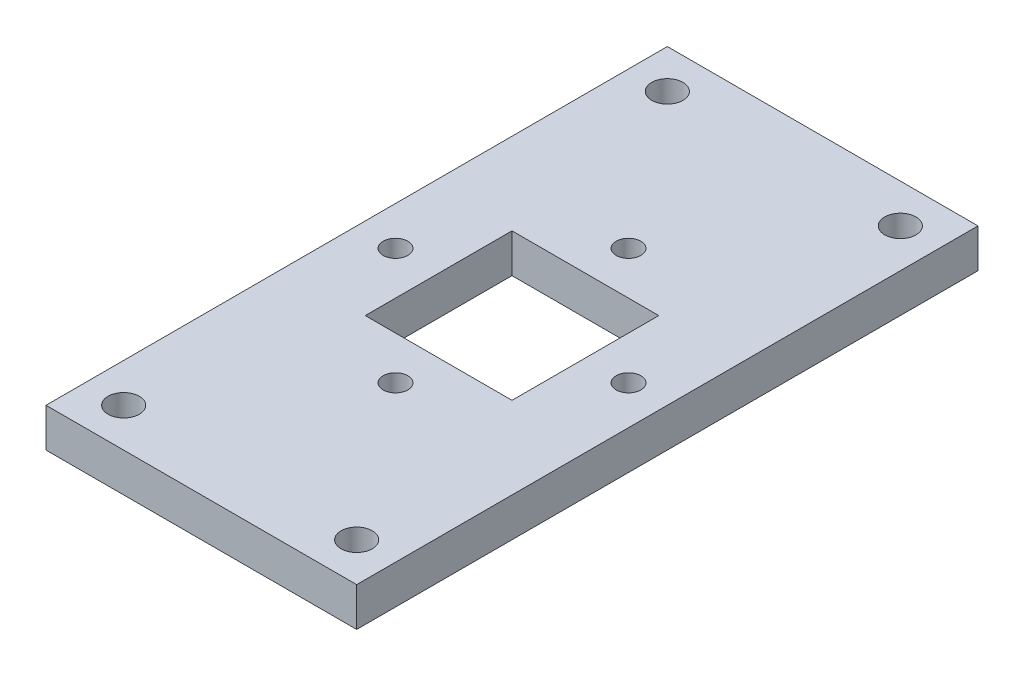
ISO-10303-21;
HEADER;
FILE_DESCRIPTION(('STEP AP214'),'2;1');
FILE_NAME('part.step','',(''),(''),'','','');
FILE_SCHEMA(('AUTOMOTIVE_DESIGN { 1 0 10303 214 1 1 1 1 }'));
ENDSEC;
DATA;
#1=APPLICATION_CONTEXT('core data for automotive mechanical design processes');
#2=APPLICATION_PROTOCOL_DEFINITION('international standard','automotive_design',2000,#1);
#3=PRODUCT_CONTEXT('',#1,'mechanical');
#4=PRODUCT('Part','Part','',(#3));
#5=PRODUCT_RELATED_PRODUCT_CATEGORY('part','',(#4));
#6=PRODUCT_DEFINITION_FORMATION('','',#4);
#7=PRODUCT_DEFINITION_CONTEXT('part definition',#1,'design');
#8=PRODUCT_DEFINITION('design','',#6,#7);
#9=PRODUCT_DEFINITION_SHAPE('','',#8);
#10=(LENGTH_UNIT() NAMED_UNIT(*) SI_UNIT(.MILLI.,.METRE.));
#11=(NAMED_UNIT(*) PLANE_ANGLE_UNIT() SI_UNIT($,.RADIAN.));
#12=(NAMED_UNIT(*) SI_UNIT($,.STERADIAN.) SOLID_ANGLE_UNIT());
#13=UNCERTAINTY_MEASURE_WITH_UNIT(LENGTH_MEASURE(1.E-05),#10,'distance_accuracy_value','');
#14=(GEOMETRIC_REPRESENTATION_CONTEXT(3) GLOBAL_UNCERTAINTY_ASSIGNED_CONTEXT((#13)) GLOBAL_UNIT_ASSIGNED_CONTEXT((#10,
#11,#12)) REPRESENTATION_CONTEXT('',''));
#15=CARTESIAN_POINT('',(0.,0.,0.));
#16=DIRECTION('',(0.,0.,1.));
#17=DIRECTION('',(1.,0.,0.));
#18=AXIS2_PLACEMENT_3D('',#15,#16,#17);
#19=CARTESIAN_POINT('',(-43.46194,12.7,-50.8));
#20=DIRECTION('',(1.,0.,0.));
#21=DIRECTION('',(0.,0.,-1.));
#22=AXIS2_PLACEMENT_3D('',#19,#20,#21);
#23=PLANE('',#22);
#24=DIRECTION('',(0.,0.,-1.));
#25=VECTOR('',#24,1.);
#26=CARTESIAN_POINT('',(-43.46194,19.05,-50.8));
#27=LINE('',#26,#25);
#28=CARTESIAN_POINT('',(-43.46194,19.05,50.8));
#29=VERTEX_POINT('',#28);
#30=CARTESIAN_POINT('',(-43.46194,19.05,-50.8));
#31=VERTEX_POINT('',#30);
#32=EDGE_CURVE('E121',#29,#31,#27,.T.);
#33=ORIENTED_EDGE('',*,*,#32,.F.);
#34=DIRECTION('',(0.,1.,0.));
#35=VECTOR('',#34,1.);
#36=CARTESIAN_POINT('',(-43.46194,12.7,50.8));
#37=LINE('',#36,#35);
#38=CARTESIAN_POINT('',(-43.46194,12.7,50.8));
#39=VERTEX_POINT('',#38);
#40=EDGE_CURVE('E11',#39,#29,#37,.T.);
#41=ORIENTED_EDGE('',*,*,#40,.F.);
#42=DIRECTION('',(0.,0.,-1.));
#43=VECTOR('',#42,1.);
#44=CARTESIAN_POINT('',(-43.46194,12.7,-50.8));
#45=LINE('',#44,#43);
#46=CARTESIAN_POINT('',(-43.46194,12.7,-50.8));
#47=VERTEX_POINT('',#46);
#48=EDGE_CURVE('E153',#39,#47,#45,.T.);
#49=ORIENTED_EDGE('',*,*,#48,.T.);
#50=DIRECTION('',(0.,1.,0.));
#51=VECTOR('',#50,1.);
#52=CARTESIAN_POINT('',(-43.46194,12.7,-50.8));
#53=LINE('',#52,#51);
#54=EDGE_CURVE('E42',#47,#31,#53,.T.);
#55=ORIENTED_EDGE('',*,*,#54,.T.);
#56=EDGE_LOOP('',(#33,#41,#49,#55));
#57=FACE_BOUND('',#56,.T.);
#58=ADVANCED_FACE('F39',(#57),#23,.T.);
#59=CARTESIAN_POINT('',(-94.26194,12.7,50.8));
#60=DIRECTION('',(0.,0.,1.));
#61=DIRECTION('',(1.,0.,0.));
#62=AXIS2_PLACEMENT_3D('',#59,#60,#61);
#63=PLANE('',#62);
#64=DIRECTION('',(1.,0.,0.));
#65=VECTOR('',#64,1.);
#66=CARTESIAN_POINT('',(-94.26194,19.05,50.8));
#67=LINE('',#66,#65);
#68=CARTESIAN_POINT('',(-94.26194,19.05,50.8));
#69=VERTEX_POINT('',#68);
#70=EDGE_CURVE('E158',#69,#29,#67,.T.);
#71=ORIENTED_EDGE('',*,*,#70,.F.);
#72=DIRECTION('',(0.,1.,0.));
#73=VECTOR('',#72,1.);
#74=CARTESIAN_POINT('',(-94.26194,12.7,50.8));
#75=LINE('',#74,#73);
#76=CARTESIAN_POINT('',(-94.26194,12.7,50.8));
#77=VERTEX_POINT('',#76);
#78=EDGE_CURVE('E48',#77,#69,#75,.T.);
#79=ORIENTED_EDGE('',*,*,#78,.F.);
#80=DIRECTION('',(1.,0.,0.));
#81=VECTOR('',#80,1.);
#82=CARTESIAN_POINT('',(-94.26194,12.7,50.8));
#83=LINE('',#82,#81);
#84=EDGE_CURVE('E166',#77,#39,#83,.T.);
#85=ORIENTED_EDGE('',*,*,#84,.T.);
#86=ORIENTED_EDGE('',*,*,#40,.T.);
#87=EDGE_LOOP('',(#71,#79,#85,#86));
#88=FACE_BOUND('',#87,.T.);
#89=ADVANCED_FACE('F200',(#88),#63,.T.);
#90=CARTESIAN_POINT('',(-94.26194,12.7,-50.8));
#91=DIRECTION('',(-1.,0.,0.));
#92=DIRECTION('',(0.,0.,1.));
#93=AXIS2_PLACEMENT_3D('',#90,#91,#92);
#94=PLANE('',#93);
#95=DIRECTION('',(0.,0.,1.));
#96=VECTOR('',#95,1.);
#97=CARTESIAN_POINT('',(-94.26194,19.05,-50.8));
#98=LINE('',#97,#96);
#99=CARTESIAN_POINT('',(-94.26194,19.05,-50.8));
#100=VERTEX_POINT('',#99);
#101=EDGE_CURVE('E177',#100,#69,#98,.T.);
#102=ORIENTED_EDGE('',*,*,#101,.F.);
#103=DIRECTION('',(0.,1.,0.));
#104=VECTOR('',#103,1.);
#105=CARTESIAN_POINT('',(-94.26194,12.7,-50.8));
#106=LINE('',#105,#104);
#107=CARTESIAN_POINT('',(-94.26194,12.7,-50.8));
#108=VERTEX_POINT('',#107);
#109=EDGE_CURVE('E185',#108,#100,#106,.T.);
#110=ORIENTED_EDGE('',*,*,#109,.F.);
#111=DIRECTION('',(0.,0.,1.));
#112=VECTOR('',#111,1.);
#113=CARTESIAN_POINT('',(-94.26194,12.7,-50.8));
#114=LINE('',#113,#112);
#115=EDGE_CURVE('E162',#108,#77,#114,.T.);
#116=ORIENTED_EDGE('',*,*,#115,.T.);
#117=ORIENTED_EDGE('',*,*,#78,.T.);
#118=EDGE_LOOP('',(#102,#110,#116,#117));
#119=FACE_BOUND('',#118,.T.);
#120=ADVANCED_FACE('F204',(#119),#94,.T.);
#121=CARTESIAN_POINT('',(-94.26194,12.7,-50.8));
#122=DIRECTION('',(0.,0.,-1.));
#123=DIRECTION('',(-1.,0.,0.));
#124=AXIS2_PLACEMENT_3D('',#121,#122,#123);
#125=PLANE('',#124);
#126=DIRECTION('',(-1.,0.,0.));
#127=VECTOR('',#126,1.);
#128=CARTESIAN_POINT('',(-94.26194,19.05,-50.8));
#129=LINE('',#128,#127);
#130=EDGE_CURVE('E173',#31,#100,#129,.T.);
#131=ORIENTED_EDGE('',*,*,#130,.F.);
#132=ORIENTED_EDGE('',*,*,#54,.F.);
#133=DIRECTION('',(-1.,0.,0.));
#134=VECTOR('',#133,1.);
#135=CARTESIAN_POINT('',(-94.26194,12.7,-50.8));
#136=LINE('',#135,#134);
#137=EDGE_CURVE('E157',#47,#108,#136,.T.);
#138=ORIENTED_EDGE('',*,*,#137,.T.);
#139=ORIENTED_EDGE('',*,*,#109,.T.);
#140=EDGE_LOOP('',(#131,#132,#138,#139));
#141=FACE_BOUND('',#140,.T.);
#142=ADVANCED_FACE('F195',(#141),#125,.T.);
#143=CARTESIAN_POINT('',(0.,12.7,0.));
#144=DIRECTION('',(0.,1.,0.));
#145=DIRECTION('',(0.,0.,1.));
#146=AXIS2_PLACEMENT_3D('',#143,#144,#145);
#147=PLANE('',#146);
#148=CARTESIAN_POINT('',(-87.91194,12.7,0.));
#149=DIRECTION('',(0.,1.,0.));
#150=DIRECTION('',(0.,0.,1.));
#151=AXIS2_PLACEMENT_3D('',#148,#149,#150);
#152=CIRCLE('',#151,2.01930000000001);
#153=CARTESIAN_POINT('',(-87.91194,12.7,2.01930000000001));
#154=VERTEX_POINT('',#153);
#155=EDGE_CURVE('E373',#154,#154,#152,.F.);
#156=ORIENTED_EDGE('',*,*,#155,.F.);
#157=EDGE_LOOP('',(#156));
#158=FACE_BOUND('',#157,.T.);
#159=CARTESIAN_POINT('',(-49.81194,12.7,0.));
#160=DIRECTION('',(0.,1.,0.));
#161=DIRECTION('',(0.,0.,1.));
#162=AXIS2_PLACEMENT_3D('',#159,#160,#161);
#163=CIRCLE('',#162,2.0193);
#164=CARTESIAN_POINT('',(-49.81194,12.7,2.0193));
#165=VERTEX_POINT('',#164);
#166=EDGE_CURVE('E382',#165,#165,#163,.F.);
#167=ORIENTED_EDGE('',*,*,#166,.F.);
#168=EDGE_LOOP('',(#167));
#169=FACE_BOUND('',#168,.T.);
#170=CARTESIAN_POINT('',(-68.86194,12.7,-19.05));
#171=DIRECTION('',(0.,1.,0.));
#172=DIRECTION('',(0.,0.,1.));
#173=AXIS2_PLACEMENT_3D('',#170,#171,#172);
#174=CIRCLE('',#173,2.01930000000001);
#175=CARTESIAN_POINT('',(-68.86194,12.7,-17.0307));
#176=VERTEX_POINT('',#175);
#177=EDGE_CURVE('E389',#176,#176,#174,.F.);
#178=ORIENTED_EDGE('',*,*,#177,.F.);
#179=EDGE_LOOP('',(#178));
#180=FACE_BOUND('',#179,.T.);
#181=CARTESIAN_POINT('',(-68.86194,12.7,19.05));
#182=DIRECTION('',(0.,1.,0.));
#183=DIRECTION('',(0.,0.,1.));
#184=AXIS2_PLACEMENT_3D('',#181,#182,#183);
#185=CIRCLE('',#184,2.01930000000001);
#186=CARTESIAN_POINT('',(-68.86194,12.7,21.0693));
#187=VERTEX_POINT('',#186);
#188=EDGE_CURVE('E397',#187,#187,#185,.F.);
#189=ORIENTED_EDGE('',*,*,#188,.F.);
#190=EDGE_LOOP('',(#189));
#191=FACE_BOUND('',#190,.T.);
#192=CARTESIAN_POINT('',(-49.81194,12.7,44.45));
#193=DIRECTION('',(0.,1.,0.));
#194=DIRECTION('',(0.,0.,1.));
#195=AXIS2_PLACEMENT_3D('',#192,#193,#194);
#196=CIRCLE('',#195,2.5527);
#197=CARTESIAN_POINT('',(-49.81194,12.7,47.0027));
#198=VERTEX_POINT('',#197);
#199=EDGE_CURVE('E431',#198,#198,#196,.T.);
#200=ORIENTED_EDGE('',*,*,#199,.T.);
#201=EDGE_LOOP('',(#200));
#202=FACE_BOUND('',#201,.T.);
#203=CARTESIAN_POINT('',(-49.81194,12.7,-44.45));
#204=DIRECTION('',(0.,1.,0.));
#205=DIRECTION('',(0.,0.,1.));
#206=AXIS2_PLACEMENT_3D('',#203,#204,#205);
#207=CIRCLE('',#206,2.5527);
#208=CARTESIAN_POINT('',(-49.81194,12.7,-41.8973));
#209=VERTEX_POINT('',#208);
#210=EDGE_CURVE('E427',#209,#209,#207,.T.);
#211=ORIENTED_EDGE('',*,*,#210,.T.);
#212=EDGE_LOOP('',(#211));
#213=FACE_BOUND('',#212,.T.);
#214=CARTESIAN_POINT('',(-87.91194,12.7,44.45));
#215=DIRECTION('',(0.,1.,0.));
#216=DIRECTION('',(0.,0.,1.));
#217=AXIS2_PLACEMENT_3D('',#214,#215,#216);
#218=CIRCLE('',#217,2.5527);
#219=CARTESIAN_POINT('',(-87.91194,12.7,47.0027));
#220=VERTEX_POINT('',#219);
#221=EDGE_CURVE('E423',#220,#220,#218,.T.);
#222=ORIENTED_EDGE('',*,*,#221,.T.);
#223=EDGE_LOOP('',(#222));
#224=FACE_BOUND('',#223,.T.);
#225=CARTESIAN_POINT('',(-87.91194,12.7,-44.45));
#226=DIRECTION('',(0.,1.,0.));
#227=DIRECTION('',(0.,0.,1.));
#228=AXIS2_PLACEMENT_3D('',#225,#226,#227);
#229=CIRCLE('',#228,2.55270000000001);
#230=CARTESIAN_POINT('',(-87.91194,12.7,-41.8973));
#231=VERTEX_POINT('',#230);
#232=EDGE_CURVE('E412',#231,#231,#229,.T.);
#233=ORIENTED_EDGE('',*,*,#232,.T.);
#234=EDGE_LOOP('',(#233));
#235=FACE_BOUND('',#234,.T.);
#236=DIRECTION('',(1.,0.,0.));
#237=VECTOR('',#236,1.);
#238=CARTESIAN_POINT('',(-80.86194,12.7,-12.));
#239=LINE('',#238,#237);
#240=CARTESIAN_POINT('',(-80.86194,12.7,-12.));
#241=VERTEX_POINT('',#240);
#242=CARTESIAN_POINT('',(-56.86194,12.7,-12.));
#243=VERTEX_POINT('',#242);
#244=EDGE_CURVE('E127',#241,#243,#239,.T.);
#245=ORIENTED_EDGE('',*,*,#244,.F.);
#246=DIRECTION('',(0.,0.,-1.));
#247=VECTOR('',#246,1.);
#248=CARTESIAN_POINT('',(-80.86194,12.7,12.));
#249=LINE('',#248,#247);
#250=CARTESIAN_POINT('',(-80.86194,12.7,12.));
#251=VERTEX_POINT('',#250);
#252=EDGE_CURVE('E107',#251,#241,#249,.T.);
#253=ORIENTED_EDGE('',*,*,#252,.F.);
#254=DIRECTION('',(-1.,0.,0.));
#255=VECTOR('',#254,1.);
#256=CARTESIAN_POINT('',(-80.86194,12.7,12.));
#257=LINE('',#256,#255);
#258=CARTESIAN_POINT('',(-56.86194,12.7,12.));
#259=VERTEX_POINT('',#258);
#260=EDGE_CURVE('E117',#259,#251,#257,.T.);
#261=ORIENTED_EDGE('',*,*,#260,.F.);
#262=DIRECTION('',(0.,0.,1.));
#263=VECTOR('',#262,1.);
#264=CARTESIAN_POINT('',(-56.86194,12.7,12.));
#265=LINE('',#264,#263);
#266=EDGE_CURVE('E56',#243,#259,#265,.T.);
#267=ORIENTED_EDGE('',*,*,#266,.F.);
#268=EDGE_LOOP('',(#245,#253,#261,#267));
#269=FACE_BOUND('',#268,.T.);
#270=ORIENTED_EDGE('',*,*,#48,.F.);
#271=ORIENTED_EDGE('',*,*,#84,.F.);
#272=ORIENTED_EDGE('',*,*,#115,.F.);
#273=ORIENTED_EDGE('',*,*,#137,.F.);
#274=EDGE_LOOP('',(#270,#271,#272,#273));
#275=FACE_BOUND('',#274,.T.);
#276=ADVANCED_FACE('F124',(#158,#169,#180,#191,#202,#213,#224,#235,#269,#275),#147,.F.);
#277=CARTESIAN_POINT('',(0.,19.05,0.));
#278=DIRECTION('',(0.,1.,0.));
#279=DIRECTION('',(0.,0.,1.));
#280=AXIS2_PLACEMENT_3D('',#277,#278,#279);
#281=PLANE('',#280);
#282=CARTESIAN_POINT('',(-87.91194,19.05,0.));
#283=DIRECTION('',(0.,1.,0.));
#284=DIRECTION('',(0.,0.,1.));
#285=AXIS2_PLACEMENT_3D('',#282,#283,#284);
#286=CIRCLE('',#285,2.01930000000001);
#287=CARTESIAN_POINT('',(-87.91194,19.05,2.01930000000001));
#288=VERTEX_POINT('',#287);
#289=EDGE_CURVE('E370',#288,#288,#286,.T.);
#290=ORIENTED_EDGE('',*,*,#289,.F.);
#291=EDGE_LOOP('',(#290));
#292=FACE_BOUND('',#291,.T.);
#293=CARTESIAN_POINT('',(-49.81194,19.05,0.));
#294=DIRECTION('',(0.,1.,0.));
#295=DIRECTION('',(0.,0.,1.));
#296=AXIS2_PLACEMENT_3D('',#293,#294,#295);
#297=CIRCLE('',#296,2.0193);
#298=CARTESIAN_POINT('',(-49.81194,19.05,2.0193));
#299=VERTEX_POINT('',#298);
#300=EDGE_CURVE('E385',#299,#299,#297,.T.);
#301=ORIENTED_EDGE('',*,*,#300,.F.);
#302=EDGE_LOOP('',(#301));
#303=FACE_BOUND('',#302,.T.);
#304=CARTESIAN_POINT('',(-68.86194,19.05,-19.05));
#305=DIRECTION('',(0.,1.,0.));
#306=DIRECTION('',(0.,0.,1.));
#307=AXIS2_PLACEMENT_3D('',#304,#305,#306);
#308=CIRCLE('',#307,2.01930000000001);
#309=CARTESIAN_POINT('',(-68.86194,19.05,-17.0307));
#310=VERTEX_POINT('',#309);
#311=EDGE_CURVE('E393',#310,#310,#308,.T.);
#312=ORIENTED_EDGE('',*,*,#311,.F.);
#313=EDGE_LOOP('',(#312));
#314=FACE_BOUND('',#313,.T.);
#315=CARTESIAN_POINT('',(-68.86194,19.05,19.05));
#316=DIRECTION('',(0.,1.,0.));
#317=DIRECTION('',(0.,0.,1.));
#318=AXIS2_PLACEMENT_3D('',#315,#316,#317);
#319=CIRCLE('',#318,2.01930000000001);
#320=CARTESIAN_POINT('',(-68.86194,19.05,21.0693));
#321=VERTEX_POINT('',#320);
#322=EDGE_CURVE('E401',#321,#321,#319,.T.);
#323=ORIENTED_EDGE('',*,*,#322,.F.);
#324=EDGE_LOOP('',(#323));
#325=FACE_BOUND('',#324,.T.);
#326=CARTESIAN_POINT('',(-49.81194,19.05,44.45));
#327=DIRECTION('',(0.,1.,0.));
#328=DIRECTION('',(0.,0.,1.));
#329=AXIS2_PLACEMENT_3D('',#326,#327,#328);
#330=CIRCLE('',#329,2.5527);
#331=CARTESIAN_POINT('',(-49.81194,19.05,47.0027));
#332=VERTEX_POINT('',#331);
#333=EDGE_CURVE('E408',#332,#332,#330,.T.);
#334=ORIENTED_EDGE('',*,*,#333,.F.);
#335=EDGE_LOOP('',(#334));
#336=FACE_BOUND('',#335,.T.);
#337=CARTESIAN_POINT('',(-49.81194,19.05,-44.45));
#338=DIRECTION('',(0.,1.,0.));
#339=DIRECTION('',(0.,0.,-1.));
#340=AXIS2_PLACEMENT_3D('',#337,#338,#339);
#341=CIRCLE('',#340,2.5527);
#342=CARTESIAN_POINT('',(-49.81194,19.05,-41.8973));
#343=VERTEX_POINT('',#342);
#344=EDGE_CURVE('E413',#343,#343,#341,.T.);
#345=ORIENTED_EDGE('',*,*,#344,.F.);
#346=EDGE_LOOP('',(#345));
#347=FACE_BOUND('',#346,.T.);
#348=CARTESIAN_POINT('',(-87.91194,19.05,44.45));
#349=DIRECTION('',(0.,1.,0.));
#350=DIRECTION('',(0.,0.,-1.));
#351=AXIS2_PLACEMENT_3D('',#348,#349,#350);
#352=CIRCLE('',#351,2.5527);
#353=CARTESIAN_POINT('',(-87.91194,19.05,47.0027));
#354=VERTEX_POINT('',#353);
#355=EDGE_CURVE('E380',#354,#354,#352,.T.);
#356=ORIENTED_EDGE('',*,*,#355,.F.);
#357=EDGE_LOOP('',(#356));
#358=FACE_BOUND('',#357,.T.);
#359=CARTESIAN_POINT('',(-87.91194,19.05,-44.45));
#360=DIRECTION('',(0.,1.,0.));
#361=DIRECTION('',(0.,0.,1.));
#362=AXIS2_PLACEMENT_3D('',#359,#360,#361);
#363=CIRCLE('',#362,2.55270000000001);
#364=CARTESIAN_POINT('',(-87.91194,19.05,-41.8973));
#365=VERTEX_POINT('',#364);
#366=EDGE_CURVE('E375',#365,#365,#363,.T.);
#367=ORIENTED_EDGE('',*,*,#366,.F.);
#368=EDGE_LOOP('',(#367));
#369=FACE_BOUND('',#368,.T.);
#370=DIRECTION('',(0.,0.,1.));
#371=VECTOR('',#370,1.);
#372=CARTESIAN_POINT('',(-80.86194,19.05,12.));
#373=LINE('',#372,#371);
#374=CARTESIAN_POINT('',(-80.86194,19.05,-12.));
#375=VERTEX_POINT('',#374);
#376=CARTESIAN_POINT('',(-80.86194,19.05,12.));
#377=VERTEX_POINT('',#376);
#378=EDGE_CURVE('E64',#375,#377,#373,.T.);
#379=ORIENTED_EDGE('',*,*,#378,.F.);
#380=DIRECTION('',(-1.,0.,0.));
#381=VECTOR('',#380,1.);
#382=CARTESIAN_POINT('',(-80.86194,19.05,-12.));
#383=LINE('',#382,#381);
#384=CARTESIAN_POINT('',(-56.86194,19.05,-12.));
#385=VERTEX_POINT('',#384);
#386=EDGE_CURVE('E114',#385,#375,#383,.T.);
#387=ORIENTED_EDGE('',*,*,#386,.F.);
#388=DIRECTION('',(0.,0.,-1.));
#389=VECTOR('',#388,1.);
#390=CARTESIAN_POINT('',(-56.86194,19.05,12.));
#391=LINE('',#390,#389);
#392=CARTESIAN_POINT('',(-56.86194,19.05,12.));
#393=VERTEX_POINT('',#392);
#394=EDGE_CURVE('E139',#393,#385,#391,.T.);
#395=ORIENTED_EDGE('',*,*,#394,.F.);
#396=DIRECTION('',(1.,0.,0.));
#397=VECTOR('',#396,1.);
#398=CARTESIAN_POINT('',(-80.86194,19.05,12.));
#399=LINE('',#398,#397);
#400=EDGE_CURVE('E132',#377,#393,#399,.T.);
#401=ORIENTED_EDGE('',*,*,#400,.F.);
#402=EDGE_LOOP('',(#379,#387,#395,#401));
#403=FACE_BOUND('',#402,.T.);
#404=ORIENTED_EDGE('',*,*,#32,.T.);
#405=ORIENTED_EDGE('',*,*,#130,.T.);
#406=ORIENTED_EDGE('',*,*,#101,.T.);
#407=ORIENTED_EDGE('',*,*,#70,.T.);
#408=EDGE_LOOP('',(#404,#405,#406,#407));
#409=FACE_BOUND('',#408,.T.);
#410=ADVANCED_FACE('F197',(#292,#303,#314,#325,#336,#347,#358,#369,#403,#409),#281,.T.);
#411=CARTESIAN_POINT('',(-80.86194,-19.051,12.));
#412=DIRECTION('',(-1.,0.,0.));
#413=DIRECTION('',(0.,0.,1.));
#414=AXIS2_PLACEMENT_3D('',#411,#412,#413);
#415=PLANE('',#414);
#416=ORIENTED_EDGE('',*,*,#252,.T.);
#417=DIRECTION('',(0.,1.,0.));
#418=VECTOR('',#417,1.);
#419=CARTESIAN_POINT('',(-80.86194,-19.051,-12.));
#420=LINE('',#419,#418);
#421=EDGE_CURVE('E122',#241,#375,#420,.T.);
#422=ORIENTED_EDGE('',*,*,#421,.T.);
#423=ORIENTED_EDGE('',*,*,#378,.T.);
#424=DIRECTION('',(0.,1.,0.));
#425=VECTOR('',#424,1.);
#426=CARTESIAN_POINT('',(-80.86194,-19.051,12.));
#427=LINE('',#426,#425);
#428=EDGE_CURVE('E103',#251,#377,#427,.T.);
#429=ORIENTED_EDGE('',*,*,#428,.F.);
#430=EDGE_LOOP('',(#416,#422,#423,#429));
#431=FACE_BOUND('',#430,.T.);
#432=ADVANCED_FACE('F105',(#431),#415,.F.);
#433=CARTESIAN_POINT('',(-80.86194,-19.051,-12.));
#434=DIRECTION('',(0.,0.,-1.));
#435=DIRECTION('',(-1.,0.,0.));
#436=AXIS2_PLACEMENT_3D('',#433,#434,#435);
#437=PLANE('',#436);
#438=ORIENTED_EDGE('',*,*,#244,.T.);
#439=DIRECTION('',(0.,1.,0.));
#440=VECTOR('',#439,1.);
#441=CARTESIAN_POINT('',(-56.86194,-19.051,-12.));
#442=LINE('',#441,#440);
#443=EDGE_CURVE('E148',#243,#385,#442,.T.);
#444=ORIENTED_EDGE('',*,*,#443,.T.);
#445=ORIENTED_EDGE('',*,*,#386,.T.);
#446=ORIENTED_EDGE('',*,*,#421,.F.);
#447=EDGE_LOOP('',(#438,#444,#445,#446));
#448=FACE_BOUND('',#447,.T.);
#449=ADVANCED_FACE('F260',(#448),#437,.F.);
#450=CARTESIAN_POINT('',(-56.86194,-19.051,12.));
#451=DIRECTION('',(1.,0.,0.));
#452=DIRECTION('',(0.,0.,-1.));
#453=AXIS2_PLACEMENT_3D('',#450,#451,#452);
#454=PLANE('',#453);
#455=ORIENTED_EDGE('',*,*,#266,.T.);
#456=DIRECTION('',(0.,1.,0.));
#457=VECTOR('',#456,1.);
#458=CARTESIAN_POINT('',(-56.86194,-19.051,12.));
#459=LINE('',#458,#457);
#460=EDGE_CURVE('E113',#259,#393,#459,.T.);
#461=ORIENTED_EDGE('',*,*,#460,.T.);
#462=ORIENTED_EDGE('',*,*,#394,.T.);
#463=ORIENTED_EDGE('',*,*,#443,.F.);
#464=EDGE_LOOP('',(#455,#461,#462,#463));
#465=FACE_BOUND('',#464,.T.);
#466=ADVANCED_FACE('F269',(#465),#454,.F.);
#467=CARTESIAN_POINT('',(-80.86194,-19.051,12.));
#468=DIRECTION('',(0.,0.,1.));
#469=DIRECTION('',(1.,0.,0.));
#470=AXIS2_PLACEMENT_3D('',#467,#468,#469);
#471=PLANE('',#470);
#472=ORIENTED_EDGE('',*,*,#260,.T.);
#473=ORIENTED_EDGE('',*,*,#428,.T.);
#474=ORIENTED_EDGE('',*,*,#400,.T.);
#475=ORIENTED_EDGE('',*,*,#460,.F.);
#476=EDGE_LOOP('',(#472,#473,#474,#475));
#477=FACE_BOUND('',#476,.T.);
#478=ADVANCED_FACE('F118',(#477),#471,.F.);
#479=CARTESIAN_POINT('',(-87.91194,-19.05,-44.45));
#480=DIRECTION('',(0.,1.,0.));
#481=DIRECTION('',(0.,0.,1.));
#482=AXIS2_PLACEMENT_3D('',#479,#480,#481);
#483=CYLINDRICAL_SURFACE('',#482,2.55270000000001);
#484=CARTESIAN_POINT('',(-87.91194,19.05,-41.8973));
#485=CARTESIAN_POINT('',(-87.91194,18.9838541666667,-41.8973));
#486=CARTESIAN_POINT('',(-87.91194,18.9177083333333,-41.8973));
#487=CARTESIAN_POINT('',(-87.91194,18.7854166666667,-41.8973));
#488=CARTESIAN_POINT('',(-87.91194,18.7192708333333,-41.8973));
#489=CARTESIAN_POINT('',(-87.91194,18.5869791666667,-41.8973));
#490=CARTESIAN_POINT('',(-87.91194,18.5208333333333,-41.8973));
#491=CARTESIAN_POINT('',(-87.91194,18.3885416666667,-41.8973));
#492=CARTESIAN_POINT('',(-87.91194,18.3223958333333,-41.8973));
#493=CARTESIAN_POINT('',(-87.91194,18.1901041666667,-41.8973));
#494=CARTESIAN_POINT('',(-87.91194,18.1239583333333,-41.8973));
#495=CARTESIAN_POINT('',(-87.91194,17.9916666666667,-41.8973));
#496=CARTESIAN_POINT('',(-87.91194,17.9255208333333,-41.8973));
#497=CARTESIAN_POINT('',(-87.91194,17.7932291666667,-41.8973));
#498=CARTESIAN_POINT('',(-87.91194,17.7270833333333,-41.8973));
#499=CARTESIAN_POINT('',(-87.91194,17.5947916666667,-41.8973));
#500=CARTESIAN_POINT('',(-87.91194,17.5286458333333,-41.8973));
#501=CARTESIAN_POINT('',(-87.91194,17.3963541666667,-41.8973));
#502=CARTESIAN_POINT('',(-87.91194,17.3302083333333,-41.8973));
#503=CARTESIAN_POINT('',(-87.91194,17.1979166666667,-41.8973));
#504=CARTESIAN_POINT('',(-87.91194,17.1317708333333,-41.8973));
#505=CARTESIAN_POINT('',(-87.91194,16.9994791666667,-41.8973));
#506=CARTESIAN_POINT('',(-87.91194,16.9333333333333,-41.8973));
#507=CARTESIAN_POINT('',(-87.91194,16.8010416666667,-41.8973));
#508=CARTESIAN_POINT('',(-87.91194,16.7348958333333,-41.8973));
#509=CARTESIAN_POINT('',(-87.91194,16.6026041666667,-41.8973));
#510=CARTESIAN_POINT('',(-87.91194,16.5364583333333,-41.8973));
#511=CARTESIAN_POINT('',(-87.91194,16.4041666666667,-41.8973));
#512=CARTESIAN_POINT('',(-87.91194,16.3380208333333,-41.8973));
#513=CARTESIAN_POINT('',(-87.91194,16.2057291666667,-41.8973));
#514=CARTESIAN_POINT('',(-87.91194,16.1395833333333,-41.8973));
#515=CARTESIAN_POINT('',(-87.91194,16.0072916666667,-41.8973));
#516=CARTESIAN_POINT('',(-87.91194,15.9411458333333,-41.8973));
#517=CARTESIAN_POINT('',(-87.91194,15.8088541666667,-41.8973));
#518=CARTESIAN_POINT('',(-87.91194,15.7427083333333,-41.8973));
#519=CARTESIAN_POINT('',(-87.91194,15.6104166666667,-41.8973));
#520=CARTESIAN_POINT('',(-87.91194,15.5442708333333,-41.8973));
#521=CARTESIAN_POINT('',(-87.91194,15.4119791666667,-41.8973));
#522=CARTESIAN_POINT('',(-87.91194,15.3458333333333,-41.8973));
#523=CARTESIAN_POINT('',(-87.91194,15.2135416666667,-41.8973));
#524=CARTESIAN_POINT('',(-87.91194,15.1473958333333,-41.8973));
#525=CARTESIAN_POINT('',(-87.91194,15.0151041666667,-41.8973));
#526=CARTESIAN_POINT('',(-87.91194,14.9489583333333,-41.8973));
#527=CARTESIAN_POINT('',(-87.91194,14.8166666666667,-41.8973));
#528=CARTESIAN_POINT('',(-87.91194,14.7505208333333,-41.8973));
#529=CARTESIAN_POINT('',(-87.91194,14.6182291666667,-41.8973));
#530=CARTESIAN_POINT('',(-87.91194,14.5520833333333,-41.8973));
#531=CARTESIAN_POINT('',(-87.91194,14.4197916666667,-41.8973));
#532=CARTESIAN_POINT('',(-87.91194,14.3536458333333,-41.8973));
#533=CARTESIAN_POINT('',(-87.91194,14.2213541666667,-41.8973));
#534=CARTESIAN_POINT('',(-87.91194,14.1552083333333,-41.8973));
#535=CARTESIAN_POINT('',(-87.91194,14.0229166666667,-41.8973));
#536=CARTESIAN_POINT('',(-87.91194,13.9567708333333,-41.8973));
#537=CARTESIAN_POINT('',(-87.91194,13.8244791666667,-41.8973));
#538=CARTESIAN_POINT('',(-87.91194,13.7583333333333,-41.8973));
#539=CARTESIAN_POINT('',(-87.91194,13.6260416666667,-41.8973));
#540=CARTESIAN_POINT('',(-87.91194,13.5598958333333,-41.8973));
#541=CARTESIAN_POINT('',(-87.91194,13.4276041666667,-41.8973));
#542=CARTESIAN_POINT('',(-87.91194,13.3614583333333,-41.8973));
#543=CARTESIAN_POINT('',(-87.91194,13.2291666666667,-41.8973));
#544=CARTESIAN_POINT('',(-87.91194,13.1630208333333,-41.8973));
#545=CARTESIAN_POINT('',(-87.91194,13.0307291666667,-41.8973));
#546=CARTESIAN_POINT('',(-87.91194,12.9645833333333,-41.8973));
#547=CARTESIAN_POINT('',(-87.91194,12.8322916666667,-41.8973));
#548=CARTESIAN_POINT('',(-87.91194,12.7661458333333,-41.8973));
#549=CARTESIAN_POINT('',(-87.91194,12.7,-41.8973));
#550=B_SPLINE_CURVE_WITH_KNOTS('',3,(#484,#485,#486,#487,#488,#489,#490,#491,#492,#493,#494,
#495,#496,#497,#498,#499,#500,#501,#502,#503,#504,#505,#506,#507,#508,#509,#510,#511,#512,#513,
#514,#515,#516,#517,#518,#519,#520,#521,#522,#523,#524,#525,#526,#527,#528,#529,#530,#531,#532,
#533,#534,#535,#536,#537,#538,#539,#540,#541,#542,#543,#544,#545,#546,#547,#548,#549),
.UNSPECIFIED.,.F.,.F.,(4,2,2,2,2,2,2,2,2,2,2,2,2,2,2,2,2,2,2,2,2,2,2,2,2,2,2,2,2,2,2,2,4),(0.,
0.198437500000002,0.396874999999998,0.5953125,0.793750000000003,0.992187499999998,1.190625,
1.3890625,1.58750000000001,1.7859375,1.984375,2.18281250000001,2.38125,2.5796875,
2.77812500000001,2.9765625,3.175,3.37343750000001,3.571875,3.7703125,3.96875000000001,4.1671875,
4.365625,4.56406250000001,4.7625,4.96093750000001,5.15937500000001,5.3578125,5.55625000000001,
5.75468750000001,5.95312500000001,6.15156250000001,6.35000000000001),.UNSPECIFIED.);
#551=EDGE_CURVE('BSEAM287',#365,#231,#550,.T.);
#552=ORIENTED_EDGE('',*,*,#366,.T.);
#553=ORIENTED_EDGE('',*,*,#232,.F.);
#554=ORIENTED_EDGE('',*,*,#551,.T.);
#555=ORIENTED_EDGE('',*,*,#551,.F.);
#556=EDGE_LOOP('',(#552,#554,#553,#555));
#557=FACE_BOUND('',#556,.T.);
#558=ADVANCED_FACE('F287',(#557),#483,.F.);
#559=CARTESIAN_POINT('',(-87.91194,-19.05,44.45));
#560=DIRECTION('',(0.,1.,0.));
#561=DIRECTION('',(0.,0.,1.));
#562=AXIS2_PLACEMENT_3D('',#559,#560,#561);
#563=CYLINDRICAL_SURFACE('',#562,2.5527);
#564=CARTESIAN_POINT('',(-87.91194,19.05,47.0027));
#565=CARTESIAN_POINT('',(-87.91194,18.9838541666667,47.0027));
#566=CARTESIAN_POINT('',(-87.91194,18.9177083333333,47.0027));
#567=CARTESIAN_POINT('',(-87.91194,18.7854166666667,47.0027));
#568=CARTESIAN_POINT('',(-87.91194,18.7192708333333,47.0027));
#569=CARTESIAN_POINT('',(-87.91194,18.5869791666667,47.0027));
#570=CARTESIAN_POINT('',(-87.91194,18.5208333333333,47.0027));
#571=CARTESIAN_POINT('',(-87.91194,18.3885416666667,47.0027));
#572=CARTESIAN_POINT('',(-87.91194,18.3223958333333,47.0027));
#573=CARTESIAN_POINT('',(-87.91194,18.1901041666667,47.0027));
#574=CARTESIAN_POINT('',(-87.91194,18.1239583333333,47.0027));
#575=CARTESIAN_POINT('',(-87.91194,17.9916666666667,47.0027));
#576=CARTESIAN_POINT('',(-87.91194,17.9255208333333,47.0027));
#577=CARTESIAN_POINT('',(-87.91194,17.7932291666667,47.0027));
#578=CARTESIAN_POINT('',(-87.91194,17.7270833333333,47.0027));
#579=CARTESIAN_POINT('',(-87.91194,17.5947916666667,47.0027));
#580=CARTESIAN_POINT('',(-87.91194,17.5286458333333,47.0027));
#581=CARTESIAN_POINT('',(-87.91194,17.3963541666667,47.0027));
#582=CARTESIAN_POINT('',(-87.91194,17.3302083333333,47.0027));
#583=CARTESIAN_POINT('',(-87.91194,17.1979166666667,47.0027));
#584=CARTESIAN_POINT('',(-87.91194,17.1317708333333,47.0027));
#585=CARTESIAN_POINT('',(-87.91194,16.9994791666667,47.0027));
#586=CARTESIAN_POINT('',(-87.91194,16.9333333333333,47.0027));
#587=CARTESIAN_POINT('',(-87.91194,16.8010416666667,47.0027));
#588=CARTESIAN_POINT('',(-87.91194,16.7348958333333,47.0027));
#589=CARTESIAN_POINT('',(-87.91194,16.6026041666667,47.0027));
#590=CARTESIAN_POINT('',(-87.91194,16.5364583333333,47.0027));
#591=CARTESIAN_POINT('',(-87.91194,16.4041666666667,47.0027));
#592=CARTESIAN_POINT('',(-87.91194,16.3380208333333,47.0027));
#593=CARTESIAN_POINT('',(-87.91194,16.2057291666667,47.0027));
#594=CARTESIAN_POINT('',(-87.91194,16.1395833333333,47.0027));
#595=CARTESIAN_POINT('',(-87.91194,16.0072916666667,47.0027));
#596=CARTESIAN_POINT('',(-87.91194,15.9411458333333,47.0027));
#597=CARTESIAN_POINT('',(-87.91194,15.8088541666667,47.0027));
#598=CARTESIAN_POINT('',(-87.91194,15.7427083333333,47.0027));
#599=CARTESIAN_POINT('',(-87.91194,15.6104166666667,47.0027));
#600=CARTESIAN_POINT('',(-87.91194,15.5442708333333,47.0027));
#601=CARTESIAN_POINT('',(-87.91194,15.4119791666667,47.0027));
#602=CARTESIAN_POINT('',(-87.91194,15.3458333333333,47.0027));
#603=CARTESIAN_POINT('',(-87.91194,15.2135416666667,47.0027));
#604=CARTESIAN_POINT('',(-87.91194,15.1473958333333,47.0027));
#605=CARTESIAN_POINT('',(-87.91194,15.0151041666667,47.0027));
#606=CARTESIAN_POINT('',(-87.91194,14.9489583333333,47.0027));
#607=CARTESIAN_POINT('',(-87.91194,14.8166666666667,47.0027));
#608=CARTESIAN_POINT('',(-87.91194,14.7505208333333,47.0027));
#609=CARTESIAN_POINT('',(-87.91194,14.6182291666667,47.0027));
#610=CARTESIAN_POINT('',(-87.91194,14.5520833333333,47.0027));
#611=CARTESIAN_POINT('',(-87.91194,14.4197916666667,47.0027));
#612=CARTESIAN_POINT('',(-87.91194,14.3536458333333,47.0027));
#613=CARTESIAN_POINT('',(-87.91194,14.2213541666667,47.0027));
#614=CARTESIAN_POINT('',(-87.91194,14.1552083333333,47.0027));
#615=CARTESIAN_POINT('',(-87.91194,14.0229166666667,47.0027));
#616=CARTESIAN_POINT('',(-87.91194,13.9567708333333,47.0027));
#617=CARTESIAN_POINT('',(-87.91194,13.8244791666667,47.0027));
#618=CARTESIAN_POINT('',(-87.91194,13.7583333333333,47.0027));
#619=CARTESIAN_POINT('',(-87.91194,13.6260416666667,47.0027));
#620=CARTESIAN_POINT('',(-87.91194,13.5598958333333,47.0027));
#621=CARTESIAN_POINT('',(-87.91194,13.4276041666667,47.0027));
#622=CARTESIAN_POINT('',(-87.91194,13.3614583333333,47.0027));
#623=CARTESIAN_POINT('',(-87.91194,13.2291666666667,47.0027));
#624=CARTESIAN_POINT('',(-87.91194,13.1630208333333,47.0027));
#625=CARTESIAN_POINT('',(-87.91194,13.0307291666667,47.0027));
#626=CARTESIAN_POINT('',(-87.91194,12.9645833333333,47.0027));
#627=CARTESIAN_POINT('',(-87.91194,12.8322916666667,47.0027));
#628=CARTESIAN_POINT('',(-87.91194,12.7661458333333,47.0027));
#629=CARTESIAN_POINT('',(-87.91194,12.7,47.0027));
#630=B_SPLINE_CURVE_WITH_KNOTS('',3,(#564,#565,#566,#567,#568,#569,#570,#571,#572,#573,#574,
#575,#576,#577,#578,#579,#580,#581,#582,#583,#584,#585,#586,#587,#588,#589,#590,#591,#592,#593,
#594,#595,#596,#597,#598,#599,#600,#601,#602,#603,#604,#605,#606,#607,#608,#609,#610,#611,#612,
#613,#614,#615,#616,#617,#618,#619,#620,#621,#622,#623,#624,#625,#626,#627,#628,#629),
.UNSPECIFIED.,.F.,.F.,(4,2,2,2,2,2,2,2,2,2,2,2,2,2,2,2,2,2,2,2,2,2,2,2,2,2,2,2,2,2,2,2,4),(0.,
0.198437500000002,0.396874999999998,0.5953125,0.793750000000003,0.992187499999998,1.190625,
1.3890625,1.58750000000001,1.7859375,1.984375,2.18281250000001,2.38125,2.5796875,
2.77812500000001,2.9765625,3.175,3.37343750000001,3.571875,3.7703125,3.96875000000001,4.1671875,
4.365625,4.56406250000001,4.7625,4.96093750000001,5.15937500000001,5.3578125,5.55625000000001,
5.75468750000001,5.95312500000001,6.15156250000001,6.35000000000001),.UNSPECIFIED.);
#631=EDGE_CURVE('BSEAM296',#354,#220,#630,.T.);
#632=ORIENTED_EDGE('',*,*,#355,.T.);
#633=ORIENTED_EDGE('',*,*,#221,.F.);
#634=ORIENTED_EDGE('',*,*,#631,.T.);
#635=ORIENTED_EDGE('',*,*,#631,.F.);
#636=EDGE_LOOP('',(#632,#634,#633,#635));
#637=FACE_BOUND('',#636,.T.);
#638=ADVANCED_FACE('F296',(#637),#563,.F.);
#639=CARTESIAN_POINT('',(-49.81194,-19.05,-44.45));
#640=DIRECTION('',(0.,1.,0.));
#641=DIRECTION('',(0.,0.,1.));
#642=AXIS2_PLACEMENT_3D('',#639,#640,#641);
#643=CYLINDRICAL_SURFACE('',#642,2.5527);
#644=CARTESIAN_POINT('',(-49.81194,19.05,-41.8973));
#645=CARTESIAN_POINT('',(-49.81194,18.9838541666667,-41.8973));
#646=CARTESIAN_POINT('',(-49.81194,18.9177083333333,-41.8973));
#647=CARTESIAN_POINT('',(-49.81194,18.7854166666667,-41.8973));
#648=CARTESIAN_POINT('',(-49.81194,18.7192708333333,-41.8973));
#649=CARTESIAN_POINT('',(-49.81194,18.5869791666667,-41.8973));
#650=CARTESIAN_POINT('',(-49.81194,18.5208333333333,-41.8973));
#651=CARTESIAN_POINT('',(-49.81194,18.3885416666667,-41.8973));
#652=CARTESIAN_POINT('',(-49.81194,18.3223958333333,-41.8973));
#653=CARTESIAN_POINT('',(-49.81194,18.1901041666667,-41.8973));
#654=CARTESIAN_POINT('',(-49.81194,18.1239583333333,-41.8973));
#655=CARTESIAN_POINT('',(-49.81194,17.9916666666667,-41.8973));
#656=CARTESIAN_POINT('',(-49.81194,17.9255208333333,-41.8973));
#657=CARTESIAN_POINT('',(-49.81194,17.7932291666667,-41.8973));
#658=CARTESIAN_POINT('',(-49.81194,17.7270833333333,-41.8973));
#659=CARTESIAN_POINT('',(-49.81194,17.5947916666667,-41.8973));
#660=CARTESIAN_POINT('',(-49.81194,17.5286458333333,-41.8973));
#661=CARTESIAN_POINT('',(-49.81194,17.3963541666667,-41.8973));
#662=CARTESIAN_POINT('',(-49.81194,17.3302083333333,-41.8973));
#663=CARTESIAN_POINT('',(-49.81194,17.1979166666667,-41.8973));
#664=CARTESIAN_POINT('',(-49.81194,17.1317708333333,-41.8973));
#665=CARTESIAN_POINT('',(-49.81194,16.9994791666667,-41.8973));
#666=CARTESIAN_POINT('',(-49.81194,16.9333333333333,-41.8973));
#667=CARTESIAN_POINT('',(-49.81194,16.8010416666667,-41.8973));
#668=CARTESIAN_POINT('',(-49.81194,16.7348958333333,-41.8973));
#669=CARTESIAN_POINT('',(-49.81194,16.6026041666667,-41.8973));
#670=CARTESIAN_POINT('',(-49.81194,16.5364583333333,-41.8973));
#671=CARTESIAN_POINT('',(-49.81194,16.4041666666667,-41.8973));
#672=CARTESIAN_POINT('',(-49.81194,16.3380208333333,-41.8973));
#673=CARTESIAN_POINT('',(-49.81194,16.2057291666667,-41.8973));
#674=CARTESIAN_POINT('',(-49.81194,16.1395833333333,-41.8973));
#675=CARTESIAN_POINT('',(-49.81194,16.0072916666667,-41.8973));
#676=CARTESIAN_POINT('',(-49.81194,15.9411458333333,-41.8973));
#677=CARTESIAN_POINT('',(-49.81194,15.8088541666667,-41.8973));
#678=CARTESIAN_POINT('',(-49.81194,15.7427083333333,-41.8973));
#679=CARTESIAN_POINT('',(-49.81194,15.6104166666667,-41.8973));
#680=CARTESIAN_POINT('',(-49.81194,15.5442708333333,-41.8973));
#681=CARTESIAN_POINT('',(-49.81194,15.4119791666667,-41.8973));
#682=CARTESIAN_POINT('',(-49.81194,15.3458333333333,-41.8973));
#683=CARTESIAN_POINT('',(-49.81194,15.2135416666667,-41.8973));
#684=CARTESIAN_POINT('',(-49.81194,15.1473958333333,-41.8973));
#685=CARTESIAN_POINT('',(-49.81194,15.0151041666667,-41.8973));
#686=CARTESIAN_POINT('',(-49.81194,14.9489583333333,-41.8973));
#687=CARTESIAN_POINT('',(-49.81194,14.8166666666667,-41.8973));
#688=CARTESIAN_POINT('',(-49.81194,14.7505208333333,-41.8973));
#689=CARTESIAN_POINT('',(-49.81194,14.6182291666667,-41.8973));
#690=CARTESIAN_POINT('',(-49.81194,14.5520833333333,-41.8973));
#691=CARTESIAN_POINT('',(-49.81194,14.4197916666667,-41.8973));
#692=CARTESIAN_POINT('',(-49.81194,14.3536458333333,-41.8973));
#693=CARTESIAN_POINT('',(-49.81194,14.2213541666667,-41.8973));
#694=CARTESIAN_POINT('',(-49.81194,14.1552083333333,-41.8973));
#695=CARTESIAN_POINT('',(-49.81194,14.0229166666667,-41.8973));
#696=CARTESIAN_POINT('',(-49.81194,13.9567708333333,-41.8973));
#697=CARTESIAN_POINT('',(-49.81194,13.8244791666667,-41.8973));
#698=CARTESIAN_POINT('',(-49.81194,13.7583333333333,-41.8973));
#699=CARTESIAN_POINT('',(-49.81194,13.6260416666667,-41.8973));
#700=CARTESIAN_POINT('',(-49.81194,13.5598958333333,-41.8973));
#701=CARTESIAN_POINT('',(-49.81194,13.4276041666667,-41.8973));
#702=CARTESIAN_POINT('',(-49.81194,13.3614583333333,-41.8973));
#703=CARTESIAN_POINT('',(-49.81194,13.2291666666667,-41.8973));
#704=CARTESIAN_POINT('',(-49.81194,13.1630208333333,-41.8973));
#705=CARTESIAN_POINT('',(-49.81194,13.0307291666667,-41.8973));
#706=CARTESIAN_POINT('',(-49.81194,12.9645833333333,-41.8973));
#707=CARTESIAN_POINT('',(-49.81194,12.8322916666667,-41.8973));
#708=CARTESIAN_POINT('',(-49.81194,12.7661458333333,-41.8973));
#709=CARTESIAN_POINT('',(-49.81194,12.7,-41.8973));
#710=B_SPLINE_CURVE_WITH_KNOTS('',3,(#644,#645,#646,#647,#648,#649,#650,#651,#652,#653,#654,
#655,#656,#657,#658,#659,#660,#661,#662,#663,#664,#665,#666,#667,#668,#669,#670,#671,#672,#673,
#674,#675,#676,#677,#678,#679,#680,#681,#682,#683,#684,#685,#686,#687,#688,#689,#690,#691,#692,
#693,#694,#695,#696,#697,#698,#699,#700,#701,#702,#703,#704,#705,#706,#707,#708,#709),
.UNSPECIFIED.,.F.,.F.,(4,2,2,2,2,2,2,2,2,2,2,2,2,2,2,2,2,2,2,2,2,2,2,2,2,2,2,2,2,2,2,2,4),(0.,
0.198437500000002,0.396874999999998,0.5953125,0.793750000000003,0.992187499999998,1.190625,
1.3890625,1.58750000000001,1.7859375,1.984375,2.18281250000001,2.38125,2.5796875,
2.77812500000001,2.9765625,3.175,3.37343750000001,3.571875,3.7703125,3.96875000000001,4.1671875,
4.365625,4.56406250000001,4.7625,4.96093750000001,5.15937500000001,5.3578125,5.55625000000001,
5.75468750000001,5.95312500000001,6.15156250000001,6.35000000000001),.UNSPECIFIED.);
#711=EDGE_CURVE('BSEAM306',#343,#209,#710,.T.);
#712=ORIENTED_EDGE('',*,*,#344,.T.);
#713=ORIENTED_EDGE('',*,*,#210,.F.);
#714=ORIENTED_EDGE('',*,*,#711,.T.);
#715=ORIENTED_EDGE('',*,*,#711,.F.);
#716=EDGE_LOOP('',(#712,#714,#713,#715));
#717=FACE_BOUND('',#716,.T.);
#718=ADVANCED_FACE('F306',(#717),#643,.F.);
#719=CARTESIAN_POINT('',(-49.81194,-19.05,44.45));
#720=DIRECTION('',(0.,1.,0.));
#721=DIRECTION('',(0.,0.,1.));
#722=AXIS2_PLACEMENT_3D('',#719,#720,#721);
#723=CYLINDRICAL_SURFACE('',#722,2.5527);
#724=CARTESIAN_POINT('',(-49.81194,19.05,47.0027));
#725=CARTESIAN_POINT('',(-49.81194,18.9838541666667,47.0027));
#726=CARTESIAN_POINT('',(-49.81194,18.9177083333333,47.0027));
#727=CARTESIAN_POINT('',(-49.81194,18.7854166666667,47.0027));
#728=CARTESIAN_POINT('',(-49.81194,18.7192708333333,47.0027));
#729=CARTESIAN_POINT('',(-49.81194,18.5869791666667,47.0027));
#730=CARTESIAN_POINT('',(-49.81194,18.5208333333333,47.0027));
#731=CARTESIAN_POINT('',(-49.81194,18.3885416666667,47.0027));
#732=CARTESIAN_POINT('',(-49.81194,18.3223958333333,47.0027));
#733=CARTESIAN_POINT('',(-49.81194,18.1901041666667,47.0027));
#734=CARTESIAN_POINT('',(-49.81194,18.1239583333333,47.0027));
#735=CARTESIAN_POINT('',(-49.81194,17.9916666666667,47.0027));
#736=CARTESIAN_POINT('',(-49.81194,17.9255208333333,47.0027));
#737=CARTESIAN_POINT('',(-49.81194,17.7932291666667,47.0027));
#738=CARTESIAN_POINT('',(-49.81194,17.7270833333333,47.0027));
#739=CARTESIAN_POINT('',(-49.81194,17.5947916666667,47.0027));
#740=CARTESIAN_POINT('',(-49.81194,17.5286458333333,47.0027));
#741=CARTESIAN_POINT('',(-49.81194,17.3963541666667,47.0027));
#742=CARTESIAN_POINT('',(-49.81194,17.3302083333333,47.0027));
#743=CARTESIAN_POINT('',(-49.81194,17.1979166666667,47.0027));
#744=CARTESIAN_POINT('',(-49.81194,17.1317708333333,47.0027));
#745=CARTESIAN_POINT('',(-49.81194,16.9994791666667,47.0027));
#746=CARTESIAN_POINT('',(-49.81194,16.9333333333333,47.0027));
#747=CARTESIAN_POINT('',(-49.81194,16.8010416666667,47.0027));
#748=CARTESIAN_POINT('',(-49.81194,16.7348958333333,47.0027));
#749=CARTESIAN_POINT('',(-49.81194,16.6026041666667,47.0027));
#750=CARTESIAN_POINT('',(-49.81194,16.5364583333333,47.0027));
#751=CARTESIAN_POINT('',(-49.81194,16.4041666666667,47.0027));
#752=CARTESIAN_POINT('',(-49.81194,16.3380208333333,47.0027));
#753=CARTESIAN_POINT('',(-49.81194,16.2057291666667,47.0027));
#754=CARTESIAN_POINT('',(-49.81194,16.1395833333333,47.0027));
#755=CARTESIAN_POINT('',(-49.81194,16.0072916666667,47.0027));
#756=CARTESIAN_POINT('',(-49.81194,15.9411458333333,47.0027));
#757=CARTESIAN_POINT('',(-49.81194,15.8088541666667,47.0027));
#758=CARTESIAN_POINT('',(-49.81194,15.7427083333333,47.0027));
#759=CARTESIAN_POINT('',(-49.81194,15.6104166666667,47.0027));
#760=CARTESIAN_POINT('',(-49.81194,15.5442708333333,47.0027));
#761=CARTESIAN_POINT('',(-49.81194,15.4119791666667,47.0027));
#762=CARTESIAN_POINT('',(-49.81194,15.3458333333333,47.0027));
#763=CARTESIAN_POINT('',(-49.81194,15.2135416666667,47.0027));
#764=CARTESIAN_POINT('',(-49.81194,15.1473958333333,47.0027));
#765=CARTESIAN_POINT('',(-49.81194,15.0151041666667,47.0027));
#766=CARTESIAN_POINT('',(-49.81194,14.9489583333333,47.0027));
#767=CARTESIAN_POINT('',(-49.81194,14.8166666666667,47.0027));
#768=CARTESIAN_POINT('',(-49.81194,14.7505208333333,47.0027));
#769=CARTESIAN_POINT('',(-49.81194,14.6182291666667,47.0027));
#770=CARTESIAN_POINT('',(-49.81194,14.5520833333333,47.0027));
#771=CARTESIAN_POINT('',(-49.81194,14.4197916666667,47.0027));
#772=CARTESIAN_POINT('',(-49.81194,14.3536458333333,47.0027));
#773=CARTESIAN_POINT('',(-49.81194,14.2213541666667,47.0027));
#774=CARTESIAN_POINT('',(-49.81194,14.1552083333333,47.0027));
#775=CARTESIAN_POINT('',(-49.81194,14.0229166666667,47.0027));
#776=CARTESIAN_POINT('',(-49.81194,13.9567708333333,47.0027));
#777=CARTESIAN_POINT('',(-49.81194,13.8244791666667,47.0027));
#778=CARTESIAN_POINT('',(-49.81194,13.7583333333333,47.0027));
#779=CARTESIAN_POINT('',(-49.81194,13.6260416666667,47.0027));
#780=CARTESIAN_POINT('',(-49.81194,13.5598958333333,47.0027));
#781=CARTESIAN_POINT('',(-49.81194,13.4276041666667,47.0027));
#782=CARTESIAN_POINT('',(-49.81194,13.3614583333333,47.0027));
#783=CARTESIAN_POINT('',(-49.81194,13.2291666666667,47.0027));
#784=CARTESIAN_POINT('',(-49.81194,13.1630208333333,47.0027));
#785=CARTESIAN_POINT('',(-49.81194,13.0307291666667,47.0027));
#786=CARTESIAN_POINT('',(-49.81194,12.9645833333333,47.0027));
#787=CARTESIAN_POINT('',(-49.81194,12.8322916666667,47.0027));
#788=CARTESIAN_POINT('',(-49.81194,12.7661458333333,47.0027));
#789=CARTESIAN_POINT('',(-49.81194,12.7,47.0027));
#790=B_SPLINE_CURVE_WITH_KNOTS('',3,(#724,#725,#726,#727,#728,#729,#730,#731,#732,#733,#734,
#735,#736,#737,#738,#739,#740,#741,#742,#743,#744,#745,#746,#747,#748,#749,#750,#751,#752,#753,
#754,#755,#756,#757,#758,#759,#760,#761,#762,#763,#764,#765,#766,#767,#768,#769,#770,#771,#772,
#773,#774,#775,#776,#777,#778,#779,#780,#781,#782,#783,#784,#785,#786,#787,#788,#789),
.UNSPECIFIED.,.F.,.F.,(4,2,2,2,2,2,2,2,2,2,2,2,2,2,2,2,2,2,2,2,2,2,2,2,2,2,2,2,2,2,2,2,4),(0.,
0.198437500000002,0.396874999999998,0.5953125,0.793750000000003,0.992187499999998,1.190625,
1.3890625,1.58750000000001,1.7859375,1.984375,2.18281250000001,2.38125,2.5796875,
2.77812500000001,2.9765625,3.175,3.37343750000001,3.571875,3.7703125,3.96875000000001,4.1671875,
4.365625,4.56406250000001,4.7625,4.96093750000001,5.15937500000001,5.3578125,5.55625000000001,
5.75468750000001,5.95312500000001,6.15156250000001,6.35000000000001),.UNSPECIFIED.);
#791=EDGE_CURVE('BSEAM316',#332,#198,#790,.T.);
#792=ORIENTED_EDGE('',*,*,#333,.T.);
#793=ORIENTED_EDGE('',*,*,#199,.F.);
#794=ORIENTED_EDGE('',*,*,#791,.T.);
#795=ORIENTED_EDGE('',*,*,#791,.F.);
#796=EDGE_LOOP('',(#792,#794,#793,#795));
#797=FACE_BOUND('',#796,.T.);
#798=ADVANCED_FACE('F316',(#797),#723,.F.);
#799=CARTESIAN_POINT('',(-68.86194,-19.051,19.05));
#800=DIRECTION('',(0.,1.,0.));
#801=DIRECTION('',(0.,0.,1.));
#802=AXIS2_PLACEMENT_3D('',#799,#800,#801);
#803=CYLINDRICAL_SURFACE('',#802,2.01930000000001);
#804=ORIENTED_EDGE('',*,*,#322,.T.);
#805=EDGE_LOOP('',(#804));
#806=FACE_BOUND('',#805,.T.);
#807=ORIENTED_EDGE('',*,*,#188,.T.);
#808=EDGE_LOOP('',(#807));
#809=FACE_BOUND('',#808,.T.);
#810=ADVANCED_FACE('F325',(#806,#809),#803,.F.);
#811=CARTESIAN_POINT('',(-68.86194,-19.051,-19.05));
#812=DIRECTION('',(0.,1.,0.));
#813=DIRECTION('',(0.,0.,1.));
#814=AXIS2_PLACEMENT_3D('',#811,#812,#813);
#815=CYLINDRICAL_SURFACE('',#814,2.01930000000001);
#816=ORIENTED_EDGE('',*,*,#311,.T.);
#817=EDGE_LOOP('',(#816));
#818=FACE_BOUND('',#817,.T.);
#819=ORIENTED_EDGE('',*,*,#177,.T.);
#820=EDGE_LOOP('',(#819));
#821=FACE_BOUND('',#820,.T.);
#822=ADVANCED_FACE('F334',(#818,#821),#815,.F.);
#823=CARTESIAN_POINT('',(-49.81194,-19.051,0.));
#824=DIRECTION('',(0.,1.,0.));
#825=DIRECTION('',(0.,0.,1.));
#826=AXIS2_PLACEMENT_3D('',#823,#824,#825);
#827=CYLINDRICAL_SURFACE('',#826,2.0193);
#828=ORIENTED_EDGE('',*,*,#300,.T.);
#829=EDGE_LOOP('',(#828));
#830=FACE_BOUND('',#829,.T.);
#831=ORIENTED_EDGE('',*,*,#166,.T.);
#832=EDGE_LOOP('',(#831));
#833=FACE_BOUND('',#832,.T.);
#834=ADVANCED_FACE('F344',(#830,#833),#827,.F.);
#835=CARTESIAN_POINT('',(-87.91194,-19.051,0.));
#836=DIRECTION('',(0.,1.,0.));
#837=DIRECTION('',(0.,0.,1.));
#838=AXIS2_PLACEMENT_3D('',#835,#836,#837);
#839=CYLINDRICAL_SURFACE('',#838,2.01930000000001);
#840=ORIENTED_EDGE('',*,*,#289,.T.);
#841=EDGE_LOOP('',(#840));
#842=FACE_BOUND('',#841,.T.);
#843=ORIENTED_EDGE('',*,*,#155,.T.);
#844=EDGE_LOOP('',(#843));
#845=FACE_BOUND('',#844,.T.);
#846=ADVANCED_FACE('F354',(#842,#845),#839,.F.);
#847=CLOSED_SHELL('',(#58,#89,#120,#142,#276,#410,#432,#449,#466,#478,#558,#638,#718,#798,#810,
#822,#834,#846));
#848=MANIFOLD_SOLID_BREP('B2',#847);
#849=ADVANCED_BREP_SHAPE_REPRESENTATION('',(#18,#848),#14);
#850=SHAPE_DEFINITION_REPRESENTATION(#9,#849);
ENDSEC;
END-ISO-10303-21;
